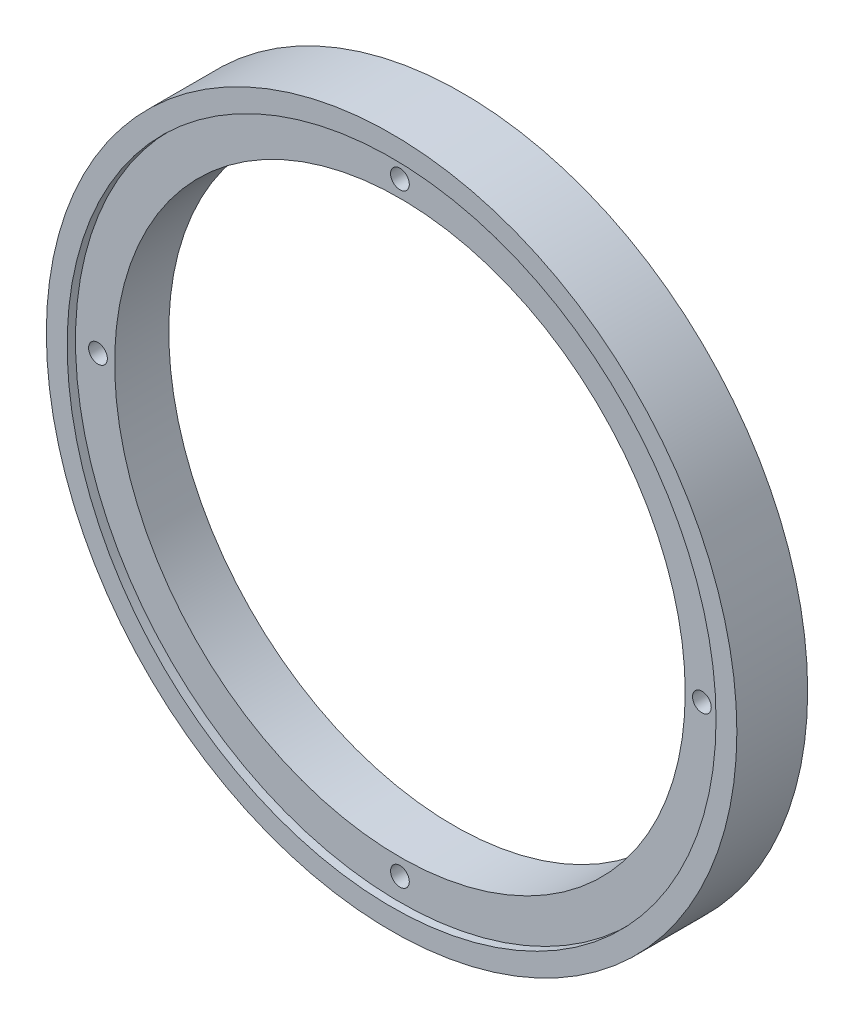
ISO-10303-21;
HEADER;
FILE_DESCRIPTION(('STEP AP214'),'2;1');
FILE_NAME('part.step','',(''),(''),'','','');
FILE_SCHEMA(('AUTOMOTIVE_DESIGN { 1 0 10303 214 1 1 1 1 }'));
ENDSEC;
DATA;
#1=APPLICATION_CONTEXT('core data for automotive mechanical design processes');
#2=APPLICATION_PROTOCOL_DEFINITION('international standard','automotive_design',2000,#1);
#3=PRODUCT_CONTEXT('',#1,'mechanical');
#4=PRODUCT('Part','Part','',(#3));
#5=PRODUCT_RELATED_PRODUCT_CATEGORY('part','',(#4));
#6=PRODUCT_DEFINITION_FORMATION('','',#4);
#7=PRODUCT_DEFINITION_CONTEXT('part definition',#1,'design');
#8=PRODUCT_DEFINITION('design','',#6,#7);
#9=PRODUCT_DEFINITION_SHAPE('','',#8);
#10=(LENGTH_UNIT() NAMED_UNIT(*) SI_UNIT(.MILLI.,.METRE.));
#11=(NAMED_UNIT(*) PLANE_ANGLE_UNIT() SI_UNIT($,.RADIAN.));
#12=(NAMED_UNIT(*) SI_UNIT($,.STERADIAN.) SOLID_ANGLE_UNIT());
#13=UNCERTAINTY_MEASURE_WITH_UNIT(LENGTH_MEASURE(1.E-05),#10,'distance_accuracy_value','');
#14=(GEOMETRIC_REPRESENTATION_CONTEXT(3) GLOBAL_UNCERTAINTY_ASSIGNED_CONTEXT((#13)) GLOBAL_UNIT_ASSIGNED_CONTEXT((#10,
#11,#12)) REPRESENTATION_CONTEXT('',''));
#15=CARTESIAN_POINT('',(0.,0.,0.));
#16=DIRECTION('',(0.,0.,1.));
#17=DIRECTION('',(1.,0.,0.));
#18=AXIS2_PLACEMENT_3D('',#15,#16,#17);
#19=CARTESIAN_POINT('',(2.20108261775833E-12,72.5,13.));
#20=DIRECTION('',(0.,0.,-1.));
#21=DIRECTION('',(-1.,0.,0.));
#22=AXIS2_PLACEMENT_3D('',#19,#20,#21);
#23=CYLINDRICAL_SURFACE('',#22,2.25);
#24=CARTESIAN_POINT('',(2.20108261775833E-12,72.5,13.));
#25=DIRECTION('',(0.,0.,1.));
#26=DIRECTION('',(1.,0.,0.));
#27=AXIS2_PLACEMENT_3D('',#24,#25,#26);
#28=CIRCLE('',#27,2.25);
#29=CARTESIAN_POINT('',(2.2500000000022,72.5,13.));
#30=VERTEX_POINT('',#29);
#31=EDGE_CURVE('E10',#30,#30,#28,.T.);
#32=ORIENTED_EDGE('',*,*,#31,.T.);
#33=EDGE_LOOP('',(#32));
#34=FACE_BOUND('',#33,.T.);
#35=CARTESIAN_POINT('',(2.20108261775833E-12,72.5,0.));
#36=DIRECTION('',(0.,0.,1.));
#37=DIRECTION('',(1.,0.,0.));
#38=AXIS2_PLACEMENT_3D('',#35,#36,#37);
#39=CIRCLE('',#38,2.25);
#40=CARTESIAN_POINT('',(2.2500000000022,72.5,0.));
#41=VERTEX_POINT('',#40);
#42=EDGE_CURVE('E72',#41,#41,#39,.T.);
#43=ORIENTED_EDGE('',*,*,#42,.F.);
#44=EDGE_LOOP('',(#43));
#45=FACE_BOUND('',#44,.T.);
#46=ADVANCED_FACE('F43',(#34,#45),#23,.F.);
#47=CARTESIAN_POINT('',(72.5,-2.45421501482446E-12,13.));
#48=DIRECTION('',(0.,0.,-1.));
#49=DIRECTION('',(-1.,0.,0.));
#50=AXIS2_PLACEMENT_3D('',#47,#48,#49);
#51=CYLINDRICAL_SURFACE('',#50,2.25);
#52=CARTESIAN_POINT('',(72.5,-2.45421501482446E-12,13.));
#53=DIRECTION('',(0.,0.,1.));
#54=DIRECTION('',(1.,0.,0.));
#55=AXIS2_PLACEMENT_3D('',#52,#53,#54);
#56=CIRCLE('',#55,2.25);
#57=CARTESIAN_POINT('',(74.75,-2.45421501482446E-12,13.));
#58=VERTEX_POINT('',#57);
#59=EDGE_CURVE('E51',#58,#58,#56,.T.);
#60=ORIENTED_EDGE('',*,*,#59,.T.);
#61=EDGE_LOOP('',(#60));
#62=FACE_BOUND('',#61,.T.);
#63=CARTESIAN_POINT('',(72.5,-2.45421501482446E-12,0.));
#64=DIRECTION('',(0.,0.,1.));
#65=DIRECTION('',(1.,0.,0.));
#66=AXIS2_PLACEMENT_3D('',#63,#64,#65);
#67=CIRCLE('',#66,2.25);
#68=CARTESIAN_POINT('',(74.75,-2.45421501482446E-12,0.));
#69=VERTEX_POINT('',#68);
#70=EDGE_CURVE('E70',#69,#69,#67,.T.);
#71=ORIENTED_EDGE('',*,*,#70,.F.);
#72=EDGE_LOOP('',(#71));
#73=FACE_BOUND('',#72,.T.);
#74=ADVANCED_FACE('F135',(#62,#73),#51,.F.);
#75=CARTESIAN_POINT('',(-2.70734741189059E-12,-72.5,13.));
#76=DIRECTION('',(0.,0.,-1.));
#77=DIRECTION('',(-1.,0.,0.));
#78=AXIS2_PLACEMENT_3D('',#75,#76,#77);
#79=CYLINDRICAL_SURFACE('',#78,2.25);
#80=CARTESIAN_POINT('',(-2.70734741189059E-12,-72.5,13.));
#81=DIRECTION('',(0.,0.,1.));
#82=DIRECTION('',(1.,0.,0.));
#83=AXIS2_PLACEMENT_3D('',#80,#81,#82);
#84=CIRCLE('',#83,2.25);
#85=CARTESIAN_POINT('',(2.24999999999729,-72.5,13.));
#86=VERTEX_POINT('',#85);
#87=EDGE_CURVE('E56',#86,#86,#84,.T.);
#88=ORIENTED_EDGE('',*,*,#87,.T.);
#89=EDGE_LOOP('',(#88));
#90=FACE_BOUND('',#89,.T.);
#91=CARTESIAN_POINT('',(-2.70734741189059E-12,-72.5,0.));
#92=DIRECTION('',(0.,0.,1.));
#93=DIRECTION('',(1.,0.,0.));
#94=AXIS2_PLACEMENT_3D('',#91,#92,#93);
#95=CIRCLE('',#94,2.25);
#96=CARTESIAN_POINT('',(2.24999999999729,-72.5,0.));
#97=VERTEX_POINT('',#96);
#98=EDGE_CURVE('E67',#97,#97,#95,.T.);
#99=ORIENTED_EDGE('',*,*,#98,.F.);
#100=EDGE_LOOP('',(#99));
#101=FACE_BOUND('',#100,.T.);
#102=ADVANCED_FACE('F92',(#90,#101),#79,.F.);
#103=CARTESIAN_POINT('',(-72.5,2.9466020211489E-12,13.));
#104=DIRECTION('',(0.,0.,-1.));
#105=DIRECTION('',(-1.,0.,0.));
#106=AXIS2_PLACEMENT_3D('',#103,#104,#105);
#107=CYLINDRICAL_SURFACE('',#106,2.25);
#108=CARTESIAN_POINT('',(-72.5,2.9466020211489E-12,13.));
#109=DIRECTION('',(0.,0.,1.));
#110=DIRECTION('',(1.,0.,0.));
#111=AXIS2_PLACEMENT_3D('',#108,#109,#110);
#112=CIRCLE('',#111,2.25);
#113=CARTESIAN_POINT('',(-70.25,2.9466020211489E-12,13.));
#114=VERTEX_POINT('',#113);
#115=EDGE_CURVE('E81',#114,#114,#112,.T.);
#116=ORIENTED_EDGE('',*,*,#115,.T.);
#117=EDGE_LOOP('',(#116));
#118=FACE_BOUND('',#117,.T.);
#119=CARTESIAN_POINT('',(-72.5,2.9466020211489E-12,0.));
#120=DIRECTION('',(0.,0.,1.));
#121=DIRECTION('',(1.,0.,0.));
#122=AXIS2_PLACEMENT_3D('',#119,#120,#121);
#123=CIRCLE('',#122,2.25);
#124=CARTESIAN_POINT('',(-70.25,2.9466020211489E-12,0.));
#125=VERTEX_POINT('',#124);
#126=EDGE_CURVE('E63',#125,#125,#123,.T.);
#127=ORIENTED_EDGE('',*,*,#126,.F.);
#128=EDGE_LOOP('',(#127));
#129=FACE_BOUND('',#128,.T.);
#130=ADVANCED_FACE('F146',(#118,#129),#107,.F.);
#131=CARTESIAN_POINT('',(2.21699690291325E-12,0.,13.));
#132=DIRECTION('',(0.,0.,-1.));
#133=DIRECTION('',(-1.,0.,0.));
#134=AXIS2_PLACEMENT_3D('',#131,#132,#133);
#135=CYLINDRICAL_SURFACE('',#134,68.5);
#136=CARTESIAN_POINT('',(2.21699690291325E-12,0.,13.));
#137=DIRECTION('',(0.,0.,1.));
#138=DIRECTION('',(1.,0.,0.));
#139=AXIS2_PLACEMENT_3D('',#136,#137,#138);
#140=CIRCLE('',#139,68.5);
#141=CARTESIAN_POINT('',(68.5000000000022,0.,13.));
#142=VERTEX_POINT('',#141);
#143=EDGE_CURVE('E77',#142,#142,#140,.T.);
#144=ORIENTED_EDGE('',*,*,#143,.T.);
#145=EDGE_LOOP('',(#144));
#146=FACE_BOUND('',#145,.T.);
#147=CARTESIAN_POINT('',(2.21699690291325E-12,0.,0.));
#148=DIRECTION('',(0.,0.,1.));
#149=DIRECTION('',(1.,0.,0.));
#150=AXIS2_PLACEMENT_3D('',#147,#148,#149);
#151=CIRCLE('',#150,68.5);
#152=CARTESIAN_POINT('',(68.5000000000022,0.,0.));
#153=VERTEX_POINT('',#152);
#154=EDGE_CURVE('E60',#153,#153,#151,.T.);
#155=ORIENTED_EDGE('',*,*,#154,.F.);
#156=EDGE_LOOP('',(#155));
#157=FACE_BOUND('',#156,.T.);
#158=ADVANCED_FACE('F45',(#146,#157),#135,.F.);
#159=CARTESIAN_POINT('',(0.,0.,13.));
#160=DIRECTION('',(0.,0.,1.));
#161=DIRECTION('',(1.,0.,0.));
#162=AXIS2_PLACEMENT_3D('',#159,#160,#161);
#163=PLANE('',#162);
#164=ORIENTED_EDGE('',*,*,#143,.F.);
#165=EDGE_LOOP('',(#164));
#166=FACE_BOUND('',#165,.T.);
#167=ORIENTED_EDGE('',*,*,#115,.F.);
#168=EDGE_LOOP('',(#167));
#169=FACE_BOUND('',#168,.T.);
#170=ORIENTED_EDGE('',*,*,#87,.F.);
#171=EDGE_LOOP('',(#170));
#172=FACE_BOUND('',#171,.T.);
#173=ORIENTED_EDGE('',*,*,#59,.F.);
#174=EDGE_LOOP('',(#173));
#175=FACE_BOUND('',#174,.T.);
#176=ORIENTED_EDGE('',*,*,#31,.F.);
#177=EDGE_LOOP('',(#176));
#178=FACE_BOUND('',#177,.T.);
#179=CARTESIAN_POINT('',(2.21699690291325E-12,0.,13.));
#180=DIRECTION('',(0.,0.,1.));
#181=DIRECTION('',(1.,0.,0.));
#182=AXIS2_PLACEMENT_3D('',#179,#180,#181);
#183=CIRCLE('',#182,77.9);
#184=CARTESIAN_POINT('',(77.9000000000023,0.,13.));
#185=VERTEX_POINT('',#184);
#186=EDGE_CURVE('E64',#185,#185,#183,.T.);
#187=ORIENTED_EDGE('',*,*,#186,.T.);
#188=EDGE_LOOP('',(#187));
#189=FACE_BOUND('',#188,.T.);
#190=ADVANCED_FACE('F95',(#166,#169,#172,#175,#178,#189),#163,.T.);
#191=CARTESIAN_POINT('',(0.,0.,0.));
#192=DIRECTION('',(0.,0.,1.));
#193=DIRECTION('',(1.,0.,0.));
#194=AXIS2_PLACEMENT_3D('',#191,#192,#193);
#195=PLANE('',#194);
#196=ORIENTED_EDGE('',*,*,#154,.T.);
#197=EDGE_LOOP('',(#196));
#198=FACE_BOUND('',#197,.T.);
#199=ORIENTED_EDGE('',*,*,#126,.T.);
#200=EDGE_LOOP('',(#199));
#201=FACE_BOUND('',#200,.T.);
#202=ORIENTED_EDGE('',*,*,#98,.T.);
#203=EDGE_LOOP('',(#202));
#204=FACE_BOUND('',#203,.T.);
#205=ORIENTED_EDGE('',*,*,#70,.T.);
#206=EDGE_LOOP('',(#205));
#207=FACE_BOUND('',#206,.T.);
#208=ORIENTED_EDGE('',*,*,#42,.T.);
#209=EDGE_LOOP('',(#208));
#210=FACE_BOUND('',#209,.T.);
#211=CARTESIAN_POINT('',(2.21699690291325E-12,0.,0.));
#212=DIRECTION('',(0.,0.,1.));
#213=DIRECTION('',(1.,0.,0.));
#214=AXIS2_PLACEMENT_3D('',#211,#212,#213);
#215=CIRCLE('',#214,77.9);
#216=CARTESIAN_POINT('',(77.9000000000023,0.,0.));
#217=VERTEX_POINT('',#216);
#218=EDGE_CURVE('E47',#217,#217,#215,.T.);
#219=ORIENTED_EDGE('',*,*,#218,.F.);
#220=EDGE_LOOP('',(#219));
#221=FACE_BOUND('',#220,.T.);
#222=ADVANCED_FACE('F98',(#198,#201,#204,#207,#210,#221),#195,.F.);
#223=CARTESIAN_POINT('',(2.21699690291325E-12,0.,-2.));
#224=DIRECTION('',(0.,0.,1.));
#225=DIRECTION('',(1.,0.,0.));
#226=AXIS2_PLACEMENT_3D('',#223,#224,#225);
#227=CYLINDRICAL_SURFACE('',#226,77.9);
#228=CARTESIAN_POINT('',(2.21699690291325E-12,0.,-2.));
#229=DIRECTION('',(0.,0.,1.));
#230=DIRECTION('',(1.,0.,0.));
#231=AXIS2_PLACEMENT_3D('',#228,#229,#230);
#232=CIRCLE('',#231,77.9);
#233=CARTESIAN_POINT('',(77.9000000000023,0.,-2.));
#234=VERTEX_POINT('',#233);
#235=EDGE_CURVE('E109',#234,#234,#232,.T.);
#236=ORIENTED_EDGE('',*,*,#235,.F.);
#237=EDGE_LOOP('',(#236));
#238=FACE_BOUND('',#237,.T.);
#239=ORIENTED_EDGE('',*,*,#218,.T.);
#240=EDGE_LOOP('',(#239));
#241=FACE_BOUND('',#240,.T.);
#242=ADVANCED_FACE('F133',(#238,#241),#227,.F.);
#243=CARTESIAN_POINT('',(2.21699690291325E-12,0.,-2.));
#244=DIRECTION('',(0.,0.,1.));
#245=DIRECTION('',(1.,0.,0.));
#246=AXIS2_PLACEMENT_3D('',#243,#244,#245);
#247=CYLINDRICAL_SURFACE('',#246,82.9);
#248=CARTESIAN_POINT('',(2.21699690291325E-12,0.,-2.));
#249=DIRECTION('',(0.,0.,1.));
#250=DIRECTION('',(1.,0.,0.));
#251=AXIS2_PLACEMENT_3D('',#248,#249,#250);
#252=CIRCLE('',#251,82.9);
#253=CARTESIAN_POINT('',(82.9000000000023,0.,-2.));
#254=VERTEX_POINT('',#253);
#255=EDGE_CURVE('E107',#254,#254,#252,.T.);
#256=ORIENTED_EDGE('',*,*,#255,.T.);
#257=EDGE_LOOP('',(#256));
#258=FACE_BOUND('',#257,.T.);
#259=CARTESIAN_POINT('',(2.21699690291325E-12,0.,15.));
#260=DIRECTION('',(0.,0.,1.));
#261=DIRECTION('',(1.,0.,0.));
#262=AXIS2_PLACEMENT_3D('',#259,#260,#261);
#263=CIRCLE('',#262,82.9);
#264=CARTESIAN_POINT('',(82.9000000000023,0.,15.));
#265=VERTEX_POINT('',#264);
#266=EDGE_CURVE('E113',#265,#265,#263,.T.);
#267=ORIENTED_EDGE('',*,*,#266,.F.);
#268=EDGE_LOOP('',(#267));
#269=FACE_BOUND('',#268,.T.);
#270=ADVANCED_FACE('F167',(#258,#269),#247,.T.);
#271=CARTESIAN_POINT('',(2.21699690291325E-12,0.,-2.));
#272=DIRECTION('',(0.,0.,1.));
#273=DIRECTION('',(1.,0.,0.));
#274=AXIS2_PLACEMENT_3D('',#271,#272,#273);
#275=PLANE('',#274);
#276=ORIENTED_EDGE('',*,*,#235,.T.);
#277=EDGE_LOOP('',(#276));
#278=FACE_BOUND('',#277,.T.);
#279=ORIENTED_EDGE('',*,*,#255,.F.);
#280=EDGE_LOOP('',(#279));
#281=FACE_BOUND('',#280,.T.);
#282=ADVANCED_FACE('F131',(#278,#281),#275,.F.);
#283=ORIENTED_EDGE('',*,*,#186,.F.);
#284=EDGE_LOOP('',(#283));
#285=FACE_BOUND('',#284,.T.);
#286=CARTESIAN_POINT('',(2.21699690291325E-12,0.,15.));
#287=DIRECTION('',(0.,0.,1.));
#288=DIRECTION('',(1.,0.,0.));
#289=AXIS2_PLACEMENT_3D('',#286,#287,#288);
#290=CIRCLE('',#289,77.9);
#291=CARTESIAN_POINT('',(77.9000000000023,0.,15.));
#292=VERTEX_POINT('',#291);
#293=EDGE_CURVE('E118',#292,#292,#290,.T.);
#294=ORIENTED_EDGE('',*,*,#293,.T.);
#295=EDGE_LOOP('',(#294));
#296=FACE_BOUND('',#295,.T.);
#297=ADVANCED_FACE('F122',(#285,#296),#227,.F.);
#298=CARTESIAN_POINT('',(2.21699690291325E-12,0.,15.));
#299=DIRECTION('',(0.,0.,1.));
#300=DIRECTION('',(1.,0.,0.));
#301=AXIS2_PLACEMENT_3D('',#298,#299,#300);
#302=PLANE('',#301);
#303=ORIENTED_EDGE('',*,*,#266,.T.);
#304=EDGE_LOOP('',(#303));
#305=FACE_BOUND('',#304,.T.);
#306=ORIENTED_EDGE('',*,*,#293,.F.);
#307=EDGE_LOOP('',(#306));
#308=FACE_BOUND('',#307,.T.);
#309=ADVANCED_FACE('F124',(#305,#308),#302,.T.);
#310=CLOSED_SHELL('',(#46,#74,#102,#130,#158,#190,#222,#242,#270,#282,#297,#309));
#311=MANIFOLD_SOLID_BREP('B2',#310);
#312=ADVANCED_BREP_SHAPE_REPRESENTATION('',(#18,#311),#14);
#313=SHAPE_DEFINITION_REPRESENTATION(#9,#312);
ENDSEC;
END-ISO-10303-21;
